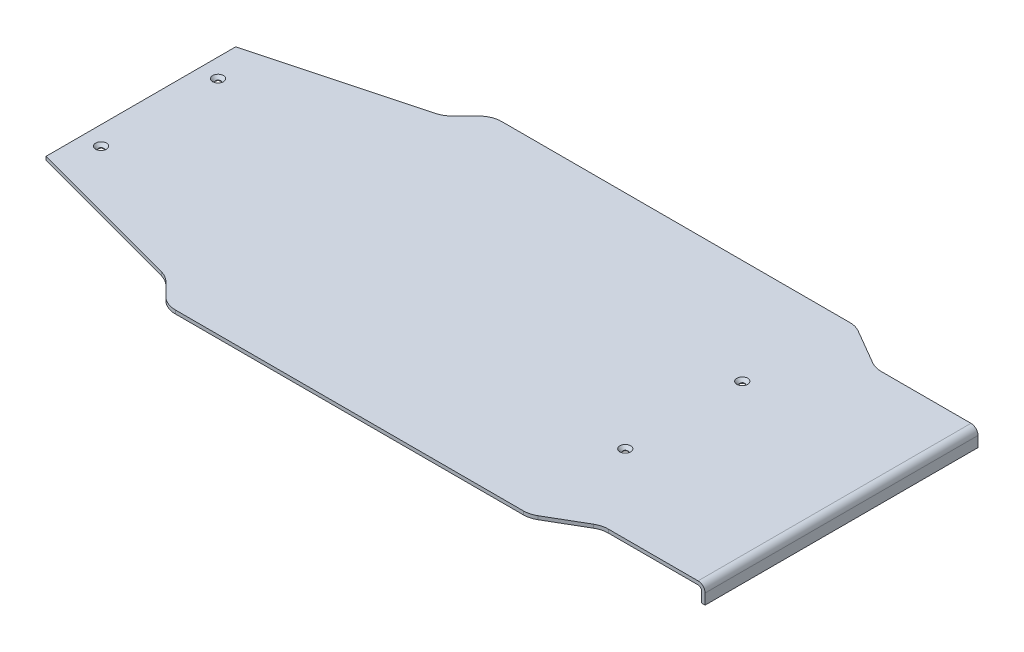
ISO-10303-21;
HEADER;
FILE_DESCRIPTION(('STEP AP214'),'2;1');
FILE_NAME('part.step','',(''),(''),'','','');
FILE_SCHEMA(('AUTOMOTIVE_DESIGN { 1 0 10303 214 1 1 1 1 }'));
ENDSEC;
DATA;
#1=APPLICATION_CONTEXT('core data for automotive mechanical design processes');
#2=APPLICATION_PROTOCOL_DEFINITION('international standard','automotive_design',2000,#1);
#3=PRODUCT_CONTEXT('',#1,'mechanical');
#4=PRODUCT('Part','Part','',(#3));
#5=PRODUCT_RELATED_PRODUCT_CATEGORY('part','',(#4));
#6=PRODUCT_DEFINITION_FORMATION('','',#4);
#7=PRODUCT_DEFINITION_CONTEXT('part definition',#1,'design');
#8=PRODUCT_DEFINITION('design','',#6,#7);
#9=PRODUCT_DEFINITION_SHAPE('','',#8);
#10=(LENGTH_UNIT() NAMED_UNIT(*) SI_UNIT(.MILLI.,.METRE.));
#11=(NAMED_UNIT(*) PLANE_ANGLE_UNIT() SI_UNIT($,.RADIAN.));
#12=(NAMED_UNIT(*) SI_UNIT($,.STERADIAN.) SOLID_ANGLE_UNIT());
#13=UNCERTAINTY_MEASURE_WITH_UNIT(LENGTH_MEASURE(1.E-05),#10,'distance_accuracy_value','');
#14=(GEOMETRIC_REPRESENTATION_CONTEXT(3) GLOBAL_UNCERTAINTY_ASSIGNED_CONTEXT((#13)) GLOBAL_UNIT_ASSIGNED_CONTEXT((#10,
#11,#12)) REPRESENTATION_CONTEXT('',''));
#15=CARTESIAN_POINT('',(0.,0.,0.));
#16=DIRECTION('',(0.,0.,1.));
#17=DIRECTION('',(1.,0.,0.));
#18=AXIS2_PLACEMENT_3D('',#15,#16,#17);
#19=CARTESIAN_POINT('',(70.1639126526197,422.155660423886,226.391038060524));
#20=DIRECTION('',(1.,0.,0.));
#21=DIRECTION('',(0.,0.,-1.));
#22=AXIS2_PLACEMENT_3D('',#19,#20,#21);
#23=PLANE('',#22);
#24=DIRECTION('',(0.,0.,-1.));
#25=VECTOR('',#24,1.);
#26=CARTESIAN_POINT('',(70.1639126526197,407.155674383528,109.733517290147));
#27=LINE('',#26,#25);
#28=CARTESIAN_POINT('',(70.1639126526197,407.155674383528,-6.92392926855557));
#29=VERTEX_POINT('',#28);
#30=CARTESIAN_POINT('',(70.1639126526197,407.155674383528,226.391038060523));
#31=VERTEX_POINT('',#30);
#32=EDGE_CURVE('E125',#29,#31,#27,.F.);
#33=ORIENTED_EDGE('',*,*,#32,.F.);
#34=DIRECTION('',(0.,1.,0.));
#35=VECTOR('',#34,1.);
#36=CARTESIAN_POINT('',(70.1639126526197,422.155660423886,-6.92392926855557));
#37=LINE('',#36,#35);
#38=CARTESIAN_POINT('',(70.1639126526197,416.155660423886,-6.92392926855556));
#39=VERTEX_POINT('',#38);
#40=EDGE_CURVE('E248',#29,#39,#37,.T.);
#41=ORIENTED_EDGE('',*,*,#40,.T.);
#42=DIRECTION('',(0.,0.,1.));
#43=VECTOR('',#42,1.);
#44=CARTESIAN_POINT('',(70.1639126526197,416.155660423886,168.062277675335));
#45=LINE('',#44,#43);
#46=CARTESIAN_POINT('',(70.1639126526197,416.155660423886,226.391038060524));
#47=VERTEX_POINT('',#46);
#48=EDGE_CURVE('E116',#47,#39,#45,.F.);
#49=ORIENTED_EDGE('',*,*,#48,.F.);
#50=DIRECTION('',(0.,1.,0.));
#51=VECTOR('',#50,1.);
#52=CARTESIAN_POINT('',(70.1639126526197,422.155660423886,226.391038060523));
#53=LINE('',#52,#51);
#54=EDGE_CURVE('E220',#47,#31,#53,.F.);
#55=ORIENTED_EDGE('',*,*,#54,.T.);
#56=EDGE_LOOP('',(#33,#41,#49,#55));
#57=FACE_BOUND('',#56,.T.);
#58=ADVANCED_FACE('F16',(#57),#23,.T.);
#59=CARTESIAN_POINT('',(-208.080405510066,407.155674383528,109.733517290147));
#60=DIRECTION('',(0.,-1.,0.));
#61=DIRECTION('',(0.,0.,-1.));
#62=AXIS2_PLACEMENT_3D('',#59,#60,#61);
#63=PLANE('',#62);
#64=ORIENTED_EDGE('',*,*,#32,.T.);
#65=DIRECTION('',(-1.,0.,0.));
#66=VECTOR('',#65,1.);
#67=CARTESIAN_POINT('',(-12.3314943924493,407.155674383528,226.391038060523));
#68=LINE('',#67,#66);
#69=CARTESIAN_POINT('',(67.1639126526197,407.155674383528,226.391038060523));
#70=VERTEX_POINT('',#69);
#71=EDGE_CURVE('E275',#31,#70,#68,.T.);
#72=ORIENTED_EDGE('',*,*,#71,.T.);
#73=DIRECTION('',(0.,0.,1.));
#74=VECTOR('',#73,1.);
#75=CARTESIAN_POINT('',(67.1639126526197,407.155674383528,226.391038060524));
#76=LINE('',#75,#74);
#77=CARTESIAN_POINT('',(67.1639126526197,407.155674383528,-6.92392926855556));
#78=VERTEX_POINT('',#77);
#79=EDGE_CURVE('E260',#78,#70,#76,.T.);
#80=ORIENTED_EDGE('',*,*,#79,.F.);
#81=DIRECTION('',(1.,0.,0.));
#82=VECTOR('',#81,1.);
#83=CARTESIAN_POINT('',(69.6639126526197,407.155674383528,-6.92392926855557));
#84=LINE('',#83,#82);
#85=EDGE_CURVE('E315',#78,#29,#84,.T.);
#86=ORIENTED_EDGE('',*,*,#85,.T.);
#87=EDGE_LOOP('',(#64,#72,#80,#86));
#88=FACE_BOUND('',#87,.T.);
#89=ADVANCED_FACE('F437',(#88),#63,.T.);
#90=CARTESIAN_POINT('',(-208.080405510066,422.155660423886,109.733517290147));
#91=DIRECTION('',(0.,1.,0.));
#92=DIRECTION('',(0.,0.,1.));
#93=AXIS2_PLACEMENT_3D('',#90,#91,#92);
#94=PLANE('',#93);
#95=CARTESIAN_POINT('',(-64.7056657946703,422.155660423925,159.733547090985));
#96=DIRECTION('',(0.,1.,0.));
#97=DIRECTION('',(0.,0.,1.));
#98=AXIS2_PLACEMENT_3D('',#95,#96,#97);
#99=CIRCLE('',#98,4.59998604033873);
#100=CARTESIAN_POINT('',(-64.7056657946703,422.155660423925,164.333533131324));
#101=VERTEX_POINT('',#100);
#102=EDGE_CURVE('E249',#101,#101,#99,.F.);
#103=ORIENTED_EDGE('',*,*,#102,.T.);
#104=EDGE_LOOP('',(#103));
#105=FACE_BOUND('',#104,.T.);
#106=CARTESIAN_POINT('',(-512.898187089314,422.155660423863,59.7335544362883));
#107=DIRECTION('',(0.,1.,0.));
#108=DIRECTION('',(0.,0.,1.));
#109=AXIS2_PLACEMENT_3D('',#106,#107,#108);
#110=CIRCLE('',#109,4.59998604037537);
#111=CARTESIAN_POINT('',(-512.898187089314,422.155660423863,64.3335404766637));
#112=VERTEX_POINT('',#111);
#113=EDGE_CURVE('E253',#112,#112,#110,.F.);
#114=ORIENTED_EDGE('',*,*,#113,.T.);
#115=EDGE_LOOP('',(#114));
#116=FACE_BOUND('',#115,.T.);
#117=CARTESIAN_POINT('',(-64.7056657946703,422.155660423925,59.7335470909851));
#118=DIRECTION('',(0.,1.,0.));
#119=DIRECTION('',(0.,0.,1.));
#120=AXIS2_PLACEMENT_3D('',#117,#118,#119);
#121=CIRCLE('',#120,4.59998604033873);
#122=CARTESIAN_POINT('',(-64.7056657946703,422.155660423925,64.3335331313238));
#123=VERTEX_POINT('',#122);
#124=EDGE_CURVE('E255',#123,#123,#121,.F.);
#125=ORIENTED_EDGE('',*,*,#124,.T.);
#126=EDGE_LOOP('',(#125));
#127=FACE_BOUND('',#126,.T.);
#128=CARTESIAN_POINT('',(-512.898187089314,422.155660423863,159.733554436288));
#129=DIRECTION('',(0.,1.,0.));
#130=DIRECTION('',(0.,0.,1.));
#131=AXIS2_PLACEMENT_3D('',#128,#129,#130);
#132=CIRCLE('',#131,4.59998604037537);
#133=CARTESIAN_POINT('',(-512.898187089314,422.155660423863,164.333540476663));
#134=VERTEX_POINT('',#133);
#135=EDGE_CURVE('E19',#134,#134,#132,.F.);
#136=ORIENTED_EDGE('',*,*,#135,.T.);
#137=EDGE_LOOP('',(#136));
#138=FACE_BOUND('',#137,.T.);
#139=CARTESIAN_POINT('',(-12.3314943924494,422.155660423886,246.891038060524));
#140=DIRECTION('',(0.,-1.,0.));
#141=DIRECTION('',(0.,0.,-1.));
#142=AXIS2_PLACEMENT_3D('',#139,#140,#141);
#143=CIRCLE('',#142,20.5000000000001);
#144=CARTESIAN_POINT('',(-22.6519145198623,422.155660423887,229.178361007247));
#145=VERTEX_POINT('',#144);
#146=CARTESIAN_POINT('',(-12.3314943924493,422.155660423886,226.391038060523));
#147=VERTEX_POINT('',#146);
#148=EDGE_CURVE('E218',#145,#147,#143,.T.);
#149=ORIENTED_EDGE('',*,*,#148,.T.);
#150=DIRECTION('',(-1.,0.,0.));
#151=VECTOR('',#150,1.);
#152=CARTESIAN_POINT('',(-12.3314943924493,422.155660423886,226.391038060523));
#153=LINE('',#152,#151);
#154=CARTESIAN_POINT('',(64.1639126526197,422.155660423886,226.391038060524));
#155=VERTEX_POINT('',#154);
#156=EDGE_CURVE('E217',#147,#155,#153,.F.);
#157=ORIENTED_EDGE('',*,*,#156,.T.);
#158=DIRECTION('',(0.,0.,1.));
#159=VECTOR('',#158,1.);
#160=CARTESIAN_POINT('',(64.1639126526197,422.155660423886,168.062277675335));
#161=LINE('',#160,#159);
#162=CARTESIAN_POINT('',(64.1639126526197,422.155660423886,-6.92392926855555));
#163=VERTEX_POINT('',#162);
#164=EDGE_CURVE('E264',#163,#155,#161,.T.);
#165=ORIENTED_EDGE('',*,*,#164,.F.);
#166=DIRECTION('',(1.,0.,0.));
#167=VECTOR('',#166,1.);
#168=CARTESIAN_POINT('',(69.6639126526197,422.155660423886,-6.92392926855557));
#169=LINE('',#168,#167);
#170=CARTESIAN_POINT('',(-12.3314943924494,422.155660423887,-6.92392926855505));
#171=VERTEX_POINT('',#170);
#172=EDGE_CURVE('E252',#163,#171,#169,.F.);
#173=ORIENTED_EDGE('',*,*,#172,.T.);
#174=CARTESIAN_POINT('',(-12.3314943924495,422.155660423887,-27.4239292685552));
#175=DIRECTION('',(0.,-1.,0.));
#176=DIRECTION('',(0.,0.,-1.));
#177=AXIS2_PLACEMENT_3D('',#174,#175,#176);
#178=CIRCLE('',#177,20.5000000000001);
#179=CARTESIAN_POINT('',(-22.6519145198625,422.155660423887,-9.71125221527799));
#180=VERTEX_POINT('',#179);
#181=EDGE_CURVE('E189',#171,#180,#178,.T.);
#182=ORIENTED_EDGE('',*,*,#181,.T.);
#183=DIRECTION('',(0.864033026989125,0.,0.503435128166489));
#184=VECTOR('',#183,1.);
#185=CARTESIAN_POINT('',(-22.6519145198625,422.155660423887,-9.71125221527797));
#186=LINE('',#185,#184);
#187=CARTESIAN_POINT('',(-52.5216947425072,422.155660423887,-27.1150969353031));
#188=VERTEX_POINT('',#187);
#189=EDGE_CURVE('E188',#180,#188,#186,.F.);
#190=ORIENTED_EDGE('',*,*,#189,.T.);
#191=CARTESIAN_POINT('',(-62.3386797417537,422.155660423887,-10.2664529090152));
#192=DIRECTION('',(0.,-1.,0.));
#193=DIRECTION('',(0.,0.,-1.));
#194=AXIS2_PLACEMENT_3D('',#191,#192,#193);
#195=CIRCLE('',#194,19.4999999999999);
#196=CARTESIAN_POINT('',(-62.3386797417538,422.155660423887,-29.7664529090151));
#197=VERTEX_POINT('',#196);
#198=EDGE_CURVE('E242',#197,#188,#195,.T.);
#199=ORIENTED_EDGE('',*,*,#198,.F.);
#200=DIRECTION('',(1.,0.,0.));
#201=VECTOR('',#200,1.);
#202=CARTESIAN_POINT('',(-62.3386797417538,422.155660423887,-29.7664529090151));
#203=LINE('',#202,#201);
#204=CARTESIAN_POINT('',(-359.91367477702,422.155660423887,-29.7664529090151));
#205=VERTEX_POINT('',#204);
#206=EDGE_CURVE('E241',#197,#205,#203,.F.);
#207=ORIENTED_EDGE('',*,*,#206,.T.);
#208=CARTESIAN_POINT('',(-359.91367477702,422.155660423887,-10.2664529090165));
#209=DIRECTION('',(0.,-1.,0.));
#210=DIRECTION('',(0.,0.,-1.));
#211=AXIS2_PLACEMENT_3D('',#208,#209,#210);
#212=CIRCLE('',#211,19.4999999999987);
#213=CARTESIAN_POINT('',(-373.702257010157,422.155660423887,-24.0550351421531));
#214=VERTEX_POINT('',#213);
#215=EDGE_CURVE('E238',#214,#205,#212,.T.);
#216=ORIENTED_EDGE('',*,*,#215,.F.);
#217=DIRECTION('',(0.707106781186547,0.,-0.707106781186548));
#218=VECTOR('',#217,1.);
#219=CARTESIAN_POINT('',(-373.702257010157,422.155660423887,-24.055035142153));
#220=LINE('',#219,#218);
#221=CARTESIAN_POINT('',(-385.021502796459,422.155660423887,-12.7357893558505));
#222=VERTEX_POINT('',#221);
#223=EDGE_CURVE('E308',#214,#222,#220,.F.);
#224=ORIENTED_EDGE('',*,*,#223,.T.);
#225=CARTESIAN_POINT('',(-399.517191810782,422.155660423887,-27.2314783701729));
#226=DIRECTION('',(0.,-1.,0.));
#227=DIRECTION('',(0.,0.,-1.));
#228=AXIS2_PLACEMENT_3D('',#225,#226,#227);
#229=CIRCLE('',#228,20.4999999999978);
#230=CARTESIAN_POINT('',(-394.211401386181,422.155660423887,-7.42999893124903));
#231=VERTEX_POINT('',#230);
#232=EDGE_CURVE('E234',#222,#231,#229,.T.);
#233=ORIENTED_EDGE('',*,*,#232,.T.);
#234=DIRECTION('',(0.965925826289068,0.,-0.258819045102521));
#235=VECTOR('',#234,1.);
#236=CARTESIAN_POINT('',(-394.211401386181,422.155660423887,-7.429998931249));
#237=LINE('',#236,#235);
#238=CARTESIAN_POINT('',(-528.898187089314,422.155660423887,28.6592165290491));
#239=VERTEX_POINT('',#238);
#240=EDGE_CURVE('E303',#231,#239,#237,.F.);
#241=ORIENTED_EDGE('',*,*,#240,.T.);
#242=DIRECTION('',(0.,0.,-1.));
#243=VECTOR('',#242,1.);
#244=CARTESIAN_POINT('',(-528.898187089314,422.155660423887,28.6592165290491));
#245=LINE('',#244,#243);
#246=CARTESIAN_POINT('',(-528.898187089314,422.155660423886,190.807892262919));
#247=VERTEX_POINT('',#246);
#248=EDGE_CURVE('E297',#239,#247,#245,.F.);
#249=ORIENTED_EDGE('',*,*,#248,.T.);
#250=DIRECTION('',(-0.965925826289068,0.,-0.258819045102521));
#251=VECTOR('',#250,1.);
#252=CARTESIAN_POINT('',(-528.898187089314,422.155660423886,190.807892262919));
#253=LINE('',#252,#251);
#254=CARTESIAN_POINT('',(-394.211401386181,422.155660423886,226.897107723217));
#255=VERTEX_POINT('',#254);
#256=EDGE_CURVE('E292',#247,#255,#253,.F.);
#257=ORIENTED_EDGE('',*,*,#256,.T.);
#258=CARTESIAN_POINT('',(-399.517191810782,422.155660423886,246.698587162141));
#259=DIRECTION('',(0.,-1.,0.));
#260=DIRECTION('',(0.,0.,-1.));
#261=AXIS2_PLACEMENT_3D('',#258,#259,#260);
#262=CIRCLE('',#261,20.4999999999979);
#263=CARTESIAN_POINT('',(-385.021502796459,422.155660423886,232.202898147819));
#264=VERTEX_POINT('',#263);
#265=EDGE_CURVE('E230',#255,#264,#262,.T.);
#266=ORIENTED_EDGE('',*,*,#265,.T.);
#267=DIRECTION('',(-0.707106781186544,0.,-0.707106781186551));
#268=VECTOR('',#267,1.);
#269=CARTESIAN_POINT('',(-385.021502796459,422.155660423886,232.202898147819));
#270=LINE('',#269,#268);
#271=CARTESIAN_POINT('',(-373.702257010157,422.155660423886,243.522143934121));
#272=VERTEX_POINT('',#271);
#273=EDGE_CURVE('E229',#264,#272,#270,.F.);
#274=ORIENTED_EDGE('',*,*,#273,.T.);
#275=CARTESIAN_POINT('',(-359.913674777019,422.155660423886,229.733561700983));
#276=DIRECTION('',(0.,-1.,0.));
#277=DIRECTION('',(0.,0.,-1.));
#278=AXIS2_PLACEMENT_3D('',#275,#276,#277);
#279=CIRCLE('',#278,19.5000000000008);
#280=CARTESIAN_POINT('',(-359.913674777019,422.155660423886,249.233561700984));
#281=VERTEX_POINT('',#280);
#282=EDGE_CURVE('E226',#281,#272,#279,.T.);
#283=ORIENTED_EDGE('',*,*,#282,.F.);
#284=DIRECTION('',(-1.,0.,0.));
#285=VECTOR('',#284,1.);
#286=CARTESIAN_POINT('',(-359.913674777019,422.155660423886,249.233561700984));
#287=LINE('',#286,#285);
#288=CARTESIAN_POINT('',(-62.3386797417537,422.155660423887,249.233561700984));
#289=VERTEX_POINT('',#288);
#290=EDGE_CURVE('E225',#281,#289,#287,.F.);
#291=ORIENTED_EDGE('',*,*,#290,.T.);
#292=CARTESIAN_POINT('',(-62.3386797417535,422.155660423887,229.733561700984));
#293=DIRECTION('',(0.,-1.,0.));
#294=DIRECTION('',(0.,0.,-1.));
#295=AXIS2_PLACEMENT_3D('',#292,#293,#294);
#296=CIRCLE('',#295,19.4999999999992);
#297=CARTESIAN_POINT('',(-52.5216947425071,422.155660423887,246.582205727272));
#298=VERTEX_POINT('',#297);
#299=EDGE_CURVE('E222',#298,#289,#296,.T.);
#300=ORIENTED_EDGE('',*,*,#299,.F.);
#301=DIRECTION('',(-0.864033026989125,0.,0.50343512816649));
#302=VECTOR('',#301,1.);
#303=CARTESIAN_POINT('',(-52.5216947425072,422.155660423887,246.582205727272));
#304=LINE('',#303,#302);
#305=EDGE_CURVE('E284',#298,#145,#304,.F.);
#306=ORIENTED_EDGE('',*,*,#305,.T.);
#307=EDGE_LOOP('',(#149,#157,#165,#173,#182,#190,#199,#207,#216,#224,#233,#241,#249,#257,#266,
#274,#283,#291,#300,#306));
#308=FACE_BOUND('',#307,.T.);
#309=ADVANCED_FACE('F447',(#105,#116,#127,#138,#308),#94,.T.);
#310=CARTESIAN_POINT('',(64.1639126526197,416.155660423886,168.062277675335));
#311=DIRECTION('',(0.,0.,1.));
#312=DIRECTION('',(0.,-1.,0.));
#313=AXIS2_PLACEMENT_3D('',#310,#311,#312);
#314=CYLINDRICAL_SURFACE('',#313,6.);
#315=CARTESIAN_POINT('',(64.1639126526197,416.155660423886,-6.92392926855556));
#316=DIRECTION('',(0.,0.,1.));
#317=DIRECTION('',(0.,-1.,0.));
#318=AXIS2_PLACEMENT_3D('',#315,#316,#317);
#319=CIRCLE('',#318,6.);
#320=EDGE_CURVE('E246',#39,#163,#319,.T.);
#321=ORIENTED_EDGE('',*,*,#320,.T.);
#322=ORIENTED_EDGE('',*,*,#164,.T.);
#323=CARTESIAN_POINT('',(64.1639126526197,416.155660423886,226.391038060524));
#324=DIRECTION('',(0.,0.,1.));
#325=DIRECTION('',(0.,-1.,0.));
#326=AXIS2_PLACEMENT_3D('',#323,#324,#325);
#327=CIRCLE('',#326,6.);
#328=EDGE_CURVE('E215',#155,#47,#327,.F.);
#329=ORIENTED_EDGE('',*,*,#328,.T.);
#330=ORIENTED_EDGE('',*,*,#48,.T.);
#331=EDGE_LOOP('',(#321,#322,#329,#330));
#332=FACE_BOUND('',#331,.T.);
#333=ADVANCED_FACE('F444',(#332),#314,.T.);
#334=CARTESIAN_POINT('',(67.1639126526197,419.155674383528,226.391038060524));
#335=DIRECTION('',(-1.,0.,0.));
#336=DIRECTION('',(0.,0.,1.));
#337=AXIS2_PLACEMENT_3D('',#334,#335,#336);
#338=PLANE('',#337);
#339=ORIENTED_EDGE('',*,*,#79,.T.);
#340=DIRECTION('',(0.,1.,0.));
#341=VECTOR('',#340,1.);
#342=CARTESIAN_POINT('',(67.1639126526197,422.155660423886,226.391038060523));
#343=LINE('',#342,#341);
#344=CARTESIAN_POINT('',(67.1639126526197,416.155674383528,226.391038060524));
#345=VERTEX_POINT('',#344);
#346=EDGE_CURVE('E278',#70,#345,#343,.T.);
#347=ORIENTED_EDGE('',*,*,#346,.T.);
#348=DIRECTION('',(0.,0.,-1.));
#349=VECTOR('',#348,1.);
#350=CARTESIAN_POINT('',(67.1639126526197,416.155674383528,168.062277675335));
#351=LINE('',#350,#349);
#352=CARTESIAN_POINT('',(67.1639126526197,416.155674383528,-6.92392926855556));
#353=VERTEX_POINT('',#352);
#354=EDGE_CURVE('E214',#345,#353,#351,.T.);
#355=ORIENTED_EDGE('',*,*,#354,.T.);
#356=DIRECTION('',(0.,1.,0.));
#357=VECTOR('',#356,1.);
#358=CARTESIAN_POINT('',(67.1639126526197,422.155660423886,-6.92392926855555));
#359=LINE('',#358,#357);
#360=EDGE_CURVE('E318',#353,#78,#359,.F.);
#361=ORIENTED_EDGE('',*,*,#360,.T.);
#362=EDGE_LOOP('',(#339,#347,#355,#361));
#363=FACE_BOUND('',#362,.T.);
#364=ADVANCED_FACE('F430',(#363),#338,.T.);
#365=CARTESIAN_POINT('',(-512.898187089314,422.155660423812,159.733554436288));
#366=DIRECTION('',(0.,1.,0.));
#367=DIRECTION('',(0.,0.,1.));
#368=AXIS2_PLACEMENT_3D('',#365,#366,#367);
#369=CONICAL_SURFACE('',#368,4.59998604032441,0.785398163397448);
#370=CARTESIAN_POINT('',(-512.898187089314,419.655674383528,159.733554436288));
#371=DIRECTION('',(0.,1.,0.));
#372=DIRECTION('',(0.,0.,1.));
#373=AXIS2_PLACEMENT_3D('',#370,#371,#372);
#374=CIRCLE('',#373,2.10000000000001);
#375=CARTESIAN_POINT('',(-512.898187089314,419.655674383528,161.833554436288));
#376=VERTEX_POINT('',#375);
#377=EDGE_CURVE('E210',#376,#376,#374,.F.);
#378=ORIENTED_EDGE('',*,*,#377,.T.);
#379=EDGE_LOOP('',(#378));
#380=FACE_BOUND('',#379,.T.);
#381=ORIENTED_EDGE('',*,*,#135,.F.);
#382=EDGE_LOOP('',(#381));
#383=FACE_BOUND('',#382,.T.);
#384=ADVANCED_FACE('F751',(#380,#383),#369,.F.);
#385=CARTESIAN_POINT('',(-64.7056657946703,422.155660423869,59.7335470909851));
#386=DIRECTION('',(0.,1.,0.));
#387=DIRECTION('',(0.,0.,1.));
#388=AXIS2_PLACEMENT_3D('',#385,#386,#387);
#389=CONICAL_SURFACE('',#388,4.59998604028189,0.78539816338608);
#390=CARTESIAN_POINT('',(-64.7056657946703,419.655674383528,59.7335470909851));
#391=DIRECTION('',(0.,1.,0.));
#392=DIRECTION('',(0.,0.,1.));
#393=AXIS2_PLACEMENT_3D('',#390,#391,#392);
#394=CIRCLE('',#393,2.1);
#395=CARTESIAN_POINT('',(-64.7056657946703,419.655674383528,61.8335470909851));
#396=VERTEX_POINT('',#395);
#397=EDGE_CURVE('E370',#396,#396,#394,.F.);
#398=ORIENTED_EDGE('',*,*,#397,.T.);
#399=EDGE_LOOP('',(#398));
#400=FACE_BOUND('',#399,.T.);
#401=ORIENTED_EDGE('',*,*,#124,.F.);
#402=EDGE_LOOP('',(#401));
#403=FACE_BOUND('',#402,.T.);
#404=ADVANCED_FACE('F742',(#400,#403),#389,.F.);
#405=CARTESIAN_POINT('',(-512.898187089314,422.155660423812,59.7335544362883));
#406=DIRECTION('',(0.,1.,0.));
#407=DIRECTION('',(0.,0.,1.));
#408=AXIS2_PLACEMENT_3D('',#405,#406,#407);
#409=CONICAL_SURFACE('',#408,4.59998604032441,0.785398163397448);
#410=CARTESIAN_POINT('',(-512.898187089314,419.655674383528,59.7335544362883));
#411=DIRECTION('',(0.,1.,0.));
#412=DIRECTION('',(0.,0.,1.));
#413=AXIS2_PLACEMENT_3D('',#410,#411,#412);
#414=CIRCLE('',#413,2.10000000000001);
#415=CARTESIAN_POINT('',(-512.898187089314,419.655674383528,61.8335544362883));
#416=VERTEX_POINT('',#415);
#417=EDGE_CURVE('E367',#416,#416,#414,.F.);
#418=ORIENTED_EDGE('',*,*,#417,.T.);
#419=EDGE_LOOP('',(#418));
#420=FACE_BOUND('',#419,.T.);
#421=ORIENTED_EDGE('',*,*,#113,.F.);
#422=EDGE_LOOP('',(#421));
#423=FACE_BOUND('',#422,.T.);
#424=ADVANCED_FACE('F733',(#420,#423),#409,.F.);
#425=CARTESIAN_POINT('',(-64.7056657946703,422.155660423869,159.733547090985));
#426=DIRECTION('',(0.,1.,0.));
#427=DIRECTION('',(0.,0.,1.));
#428=AXIS2_PLACEMENT_3D('',#425,#426,#427);
#429=CONICAL_SURFACE('',#428,4.59998604028189,0.78539816338608);
#430=CARTESIAN_POINT('',(-64.7056657946703,419.655674383528,159.733547090985));
#431=DIRECTION('',(0.,1.,0.));
#432=DIRECTION('',(0.,0.,1.));
#433=AXIS2_PLACEMENT_3D('',#430,#431,#432);
#434=CIRCLE('',#433,2.10000000000001);
#435=CARTESIAN_POINT('',(-64.7056657946703,419.655674383528,161.833547090985));
#436=VERTEX_POINT('',#435);
#437=EDGE_CURVE('E204',#436,#436,#434,.F.);
#438=ORIENTED_EDGE('',*,*,#437,.T.);
#439=EDGE_LOOP('',(#438));
#440=FACE_BOUND('',#439,.T.);
#441=ORIENTED_EDGE('',*,*,#102,.F.);
#442=EDGE_LOOP('',(#441));
#443=FACE_BOUND('',#442,.T.);
#444=ADVANCED_FACE('F725',(#440,#443),#429,.F.);
#445=CARTESIAN_POINT('',(69.6639126526197,422.155660423886,-6.92392926855557));
#446=DIRECTION('',(0.,0.,1.));
#447=DIRECTION('',(1.,0.,0.));
#448=AXIS2_PLACEMENT_3D('',#445,#446,#447);
#449=PLANE('',#448);
#450=ORIENTED_EDGE('',*,*,#40,.F.);
#451=ORIENTED_EDGE('',*,*,#85,.F.);
#452=ORIENTED_EDGE('',*,*,#360,.F.);
#453=CARTESIAN_POINT('',(64.1639126526197,416.155674383528,-6.92392926855556));
#454=DIRECTION('',(0.,0.,-1.));
#455=DIRECTION('',(0.,1.,0.));
#456=AXIS2_PLACEMENT_3D('',#453,#454,#455);
#457=CIRCLE('',#456,3.);
#458=CARTESIAN_POINT('',(64.1639126526197,419.155674383528,-6.92392926855555));
#459=VERTEX_POINT('',#458);
#460=EDGE_CURVE('E211',#353,#459,#457,.F.);
#461=ORIENTED_EDGE('',*,*,#460,.T.);
#462=DIRECTION('',(1.,0.,0.));
#463=VECTOR('',#462,1.);
#464=CARTESIAN_POINT('',(-208.080405510066,419.155674383528,-6.92392926855553));
#465=LINE('',#464,#463);
#466=CARTESIAN_POINT('',(-12.3314943924495,419.155674383528,-6.92392926855532));
#467=VERTEX_POINT('',#466);
#468=EDGE_CURVE('E202',#459,#467,#465,.F.);
#469=ORIENTED_EDGE('',*,*,#468,.T.);
#470=DIRECTION('',(0.,-1.,0.));
#471=VECTOR('',#470,1.);
#472=CARTESIAN_POINT('',(-12.3314943924494,422.155660423887,-6.9239292685551));
#473=LINE('',#472,#471);
#474=EDGE_CURVE('E175',#467,#171,#473,.F.);
#475=ORIENTED_EDGE('',*,*,#474,.T.);
#476=ORIENTED_EDGE('',*,*,#172,.F.);
#477=ORIENTED_EDGE('',*,*,#320,.F.);
#478=EDGE_LOOP('',(#450,#451,#452,#461,#469,#475,#476,#477));
#479=FACE_BOUND('',#478,.T.);
#480=ADVANCED_FACE('F434',(#479),#449,.F.);
#481=CARTESIAN_POINT('',(-12.3314943924495,422.155660423887,-27.4239292685552));
#482=DIRECTION('',(0.,-1.,0.));
#483=DIRECTION('',(0.,0.,-1.));
#484=AXIS2_PLACEMENT_3D('',#481,#482,#483);
#485=CYLINDRICAL_SURFACE('',#484,20.5000000000001);
#486=DIRECTION('',(0.,1.,0.));
#487=VECTOR('',#486,1.);
#488=CARTESIAN_POINT('',(-22.6519145198625,422.155660423887,-9.71125221527797));
#489=LINE('',#488,#487);
#490=CARTESIAN_POINT('',(-22.6519145198626,419.155674383528,-9.711252215278));
#491=VERTEX_POINT('',#490);
#492=EDGE_CURVE('E182',#491,#180,#489,.T.);
#493=ORIENTED_EDGE('',*,*,#492,.T.);
#494=ORIENTED_EDGE('',*,*,#181,.F.);
#495=ORIENTED_EDGE('',*,*,#474,.F.);
#496=CARTESIAN_POINT('',(-12.3314943924495,419.155674383528,-27.4239292685552));
#497=DIRECTION('',(0.,-1.,0.));
#498=DIRECTION('',(0.,0.,-1.));
#499=AXIS2_PLACEMENT_3D('',#496,#497,#498);
#500=CIRCLE('',#499,20.5000000000001);
#501=EDGE_CURVE('E195',#467,#491,#500,.T.);
#502=ORIENTED_EDGE('',*,*,#501,.T.);
#503=EDGE_LOOP('',(#493,#494,#495,#502));
#504=FACE_BOUND('',#503,.T.);
#505=ADVANCED_FACE('F201',(#504),#485,.F.);
#506=CARTESIAN_POINT('',(-22.6519145198625,422.155660423887,-9.71125221527797));
#507=DIRECTION('',(-0.503435128166489,0.,0.864033026989125));
#508=DIRECTION('',(0.864033026989125,0.,0.503435128166489));
#509=AXIS2_PLACEMENT_3D('',#506,#507,#508);
#510=PLANE('',#509);
#511=DIRECTION('',(0.,-1.,0.));
#512=VECTOR('',#511,1.);
#513=CARTESIAN_POINT('',(-52.5216947425072,422.155660423887,-27.1150969353031));
#514=LINE('',#513,#512);
#515=CARTESIAN_POINT('',(-52.5216947425072,419.155674383528,-27.1150969353031));
#516=VERTEX_POINT('',#515);
#517=EDGE_CURVE('E244',#188,#516,#514,.T.);
#518=ORIENTED_EDGE('',*,*,#517,.F.);
#519=ORIENTED_EDGE('',*,*,#189,.F.);
#520=ORIENTED_EDGE('',*,*,#492,.F.);
#521=DIRECTION('',(-0.864033026989125,0.,-0.50343512816649));
#522=VECTOR('',#521,1.);
#523=CARTESIAN_POINT('',(-22.6519145198625,419.155674383528,-9.71125221527797));
#524=LINE('',#523,#522);
#525=EDGE_CURVE('E186',#491,#516,#524,.T.);
#526=ORIENTED_EDGE('',*,*,#525,.T.);
#527=EDGE_LOOP('',(#518,#519,#520,#526));
#528=FACE_BOUND('',#527,.T.);
#529=ADVANCED_FACE('F185',(#528),#510,.F.);
#530=CARTESIAN_POINT('',(-62.3386797417537,422.155660423887,-10.2664529090152));
#531=DIRECTION('',(0.,-1.,0.));
#532=DIRECTION('',(0.,0.,-1.));
#533=AXIS2_PLACEMENT_3D('',#530,#531,#532);
#534=CYLINDRICAL_SURFACE('',#533,19.4999999999999);
#535=ORIENTED_EDGE('',*,*,#198,.T.);
#536=ORIENTED_EDGE('',*,*,#517,.T.);
#537=CARTESIAN_POINT('',(-62.3386797417537,419.155674383528,-10.2664529090152));
#538=DIRECTION('',(0.,-1.,0.));
#539=DIRECTION('',(0.,0.,-1.));
#540=AXIS2_PLACEMENT_3D('',#537,#538,#539);
#541=CIRCLE('',#540,19.4999999999999);
#542=CARTESIAN_POINT('',(-62.3386797417538,419.155674383528,-29.7664529090151));
#543=VERTEX_POINT('',#542);
#544=EDGE_CURVE('E199',#516,#543,#541,.F.);
#545=ORIENTED_EDGE('',*,*,#544,.T.);
#546=DIRECTION('',(0.,1.,0.));
#547=VECTOR('',#546,1.);
#548=CARTESIAN_POINT('',(-62.3386797417538,422.155660423887,-29.7664529090151));
#549=LINE('',#548,#547);
#550=EDGE_CURVE('E313',#543,#197,#549,.T.);
#551=ORIENTED_EDGE('',*,*,#550,.T.);
#552=EDGE_LOOP('',(#535,#536,#545,#551));
#553=FACE_BOUND('',#552,.T.);
#554=ADVANCED_FACE('F488',(#553),#534,.T.);
#555=CARTESIAN_POINT('',(-62.3386797417538,422.155660423887,-29.7664529090151));
#556=DIRECTION('',(0.,0.,1.));
#557=DIRECTION('',(1.,0.,0.));
#558=AXIS2_PLACEMENT_3D('',#555,#556,#557);
#559=PLANE('',#558);
#560=DIRECTION('',(0.,-1.,0.));
#561=VECTOR('',#560,1.);
#562=CARTESIAN_POINT('',(-359.91367477702,422.155660423887,-29.7664529090152));
#563=LINE('',#562,#561);
#564=CARTESIAN_POINT('',(-359.91367477702,419.155674383528,-29.7664529090152));
#565=VERTEX_POINT('',#564);
#566=EDGE_CURVE('E240',#205,#565,#563,.T.);
#567=ORIENTED_EDGE('',*,*,#566,.F.);
#568=ORIENTED_EDGE('',*,*,#206,.F.);
#569=ORIENTED_EDGE('',*,*,#550,.F.);
#570=DIRECTION('',(1.,0.,0.));
#571=VECTOR('',#570,1.);
#572=CARTESIAN_POINT('',(-208.080405510066,419.155674383528,-29.7664529090151));
#573=LINE('',#572,#571);
#574=EDGE_CURVE('E353',#543,#565,#573,.F.);
#575=ORIENTED_EDGE('',*,*,#574,.T.);
#576=EDGE_LOOP('',(#567,#568,#569,#575));
#577=FACE_BOUND('',#576,.T.);
#578=ADVANCED_FACE('F491',(#577),#559,.F.);
#579=CARTESIAN_POINT('',(-359.91367477702,422.155660423887,-10.2664529090165));
#580=DIRECTION('',(0.,-1.,0.));
#581=DIRECTION('',(0.,0.,-1.));
#582=AXIS2_PLACEMENT_3D('',#579,#580,#581);
#583=CYLINDRICAL_SURFACE('',#582,19.4999999999987);
#584=ORIENTED_EDGE('',*,*,#215,.T.);
#585=ORIENTED_EDGE('',*,*,#566,.T.);
#586=CARTESIAN_POINT('',(-359.91367477702,419.155674383528,-10.2664529090165));
#587=DIRECTION('',(0.,-1.,0.));
#588=DIRECTION('',(0.,0.,-1.));
#589=AXIS2_PLACEMENT_3D('',#586,#587,#588);
#590=CIRCLE('',#589,19.4999999999987);
#591=CARTESIAN_POINT('',(-373.702257010157,419.155674383528,-24.0550351421531));
#592=VERTEX_POINT('',#591);
#593=EDGE_CURVE('E351',#565,#592,#590,.F.);
#594=ORIENTED_EDGE('',*,*,#593,.T.);
#595=DIRECTION('',(0.,1.,0.));
#596=VECTOR('',#595,1.);
#597=CARTESIAN_POINT('',(-373.702257010157,422.155660423887,-24.055035142153));
#598=LINE('',#597,#596);
#599=EDGE_CURVE('E310',#592,#214,#598,.T.);
#600=ORIENTED_EDGE('',*,*,#599,.T.);
#601=EDGE_LOOP('',(#584,#585,#594,#600));
#602=FACE_BOUND('',#601,.T.);
#603=ADVANCED_FACE('F492',(#602),#583,.T.);
#604=CARTESIAN_POINT('',(-373.702257010157,422.155660423887,-24.055035142153));
#605=DIRECTION('',(0.707106781186548,0.,0.707106781186547));
#606=DIRECTION('',(0.707106781186547,0.,-0.707106781186548));
#607=AXIS2_PLACEMENT_3D('',#604,#605,#606);
#608=PLANE('',#607);
#609=DIRECTION('',(0.,-1.,0.));
#610=VECTOR('',#609,1.);
#611=CARTESIAN_POINT('',(-385.021502796459,422.155660423887,-12.7357893558507));
#612=LINE('',#611,#610);
#613=CARTESIAN_POINT('',(-385.021502796459,419.155674383528,-12.7357893558506));
#614=VERTEX_POINT('',#613);
#615=EDGE_CURVE('E237',#614,#222,#612,.F.);
#616=ORIENTED_EDGE('',*,*,#615,.T.);
#617=ORIENTED_EDGE('',*,*,#223,.F.);
#618=ORIENTED_EDGE('',*,*,#599,.F.);
#619=DIRECTION('',(-0.707106781186543,0.,0.707106781186552));
#620=VECTOR('',#619,1.);
#621=CARTESIAN_POINT('',(-373.702257010157,419.155674383528,-24.055035142153));
#622=LINE('',#621,#620);
#623=EDGE_CURVE('E350',#592,#614,#622,.T.);
#624=ORIENTED_EDGE('',*,*,#623,.T.);
#625=EDGE_LOOP('',(#616,#617,#618,#624));
#626=FACE_BOUND('',#625,.T.);
#627=ADVANCED_FACE('F486',(#626),#608,.F.);
#628=CARTESIAN_POINT('',(-399.517191810782,422.155660423887,-27.2314783701729));
#629=DIRECTION('',(0.,-1.,0.));
#630=DIRECTION('',(0.,0.,-1.));
#631=AXIS2_PLACEMENT_3D('',#628,#629,#630);
#632=CYLINDRICAL_SURFACE('',#631,20.4999999999978);
#633=DIRECTION('',(0.,1.,0.));
#634=VECTOR('',#633,1.);
#635=CARTESIAN_POINT('',(-394.211401386181,422.155660423887,-7.429998931249));
#636=LINE('',#635,#634);
#637=CARTESIAN_POINT('',(-394.211401386181,419.155674383528,-7.42999893124903));
#638=VERTEX_POINT('',#637);
#639=EDGE_CURVE('E236',#638,#231,#636,.T.);
#640=ORIENTED_EDGE('',*,*,#639,.T.);
#641=ORIENTED_EDGE('',*,*,#232,.F.);
#642=ORIENTED_EDGE('',*,*,#615,.F.);
#643=CARTESIAN_POINT('',(-399.517191810782,419.155674383528,-27.2314783701729));
#644=DIRECTION('',(0.,-1.,0.));
#645=DIRECTION('',(0.,0.,-1.));
#646=AXIS2_PLACEMENT_3D('',#643,#644,#645);
#647=CIRCLE('',#646,20.4999999999978);
#648=EDGE_CURVE('E347',#614,#638,#647,.T.);
#649=ORIENTED_EDGE('',*,*,#648,.T.);
#650=EDGE_LOOP('',(#640,#641,#642,#649));
#651=FACE_BOUND('',#650,.T.);
#652=ADVANCED_FACE('F482',(#651),#632,.F.);
#653=CARTESIAN_POINT('',(-394.211401386181,422.155660423887,-7.429998931249));
#654=DIRECTION('',(0.258819045102521,0.,0.965925826289068));
#655=DIRECTION('',(0.965925826289068,0.,-0.258819045102521));
#656=AXIS2_PLACEMENT_3D('',#653,#654,#655);
#657=PLANE('',#656);
#658=DIRECTION('',(0.,1.,0.));
#659=VECTOR('',#658,1.);
#660=CARTESIAN_POINT('',(-528.898187089314,422.155660423887,28.6592165290491));
#661=LINE('',#660,#659);
#662=CARTESIAN_POINT('',(-528.898187089314,419.155674383528,28.6592165290491));
#663=VERTEX_POINT('',#662);
#664=EDGE_CURVE('E300',#663,#239,#661,.T.);
#665=ORIENTED_EDGE('',*,*,#664,.T.);
#666=ORIENTED_EDGE('',*,*,#240,.F.);
#667=ORIENTED_EDGE('',*,*,#639,.F.);
#668=DIRECTION('',(-0.965925826289068,0.,0.25881904510252));
#669=VECTOR('',#668,1.);
#670=CARTESIAN_POINT('',(-394.211401386181,419.155674383528,-7.429998931249));
#671=LINE('',#670,#669);
#672=EDGE_CURVE('E349',#638,#663,#671,.T.);
#673=ORIENTED_EDGE('',*,*,#672,.T.);
#674=EDGE_LOOP('',(#665,#666,#667,#673));
#675=FACE_BOUND('',#674,.T.);
#676=ADVANCED_FACE('F473',(#675),#657,.F.);
#677=CARTESIAN_POINT('',(-528.898187089314,422.155660423887,28.6592165290491));
#678=DIRECTION('',(1.,0.,0.));
#679=DIRECTION('',(0.,0.,-1.));
#680=AXIS2_PLACEMENT_3D('',#677,#678,#679);
#681=PLANE('',#680);
#682=DIRECTION('',(0.,1.,0.));
#683=VECTOR('',#682,1.);
#684=CARTESIAN_POINT('',(-528.898187089314,422.155660423886,190.807892262919));
#685=LINE('',#684,#683);
#686=CARTESIAN_POINT('',(-528.898187089314,419.155674383528,190.807892262919));
#687=VERTEX_POINT('',#686);
#688=EDGE_CURVE('E294',#687,#247,#685,.T.);
#689=ORIENTED_EDGE('',*,*,#688,.T.);
#690=ORIENTED_EDGE('',*,*,#248,.F.);
#691=ORIENTED_EDGE('',*,*,#664,.F.);
#692=DIRECTION('',(0.,0.,1.));
#693=VECTOR('',#692,1.);
#694=CARTESIAN_POINT('',(-528.898187089314,419.155674383528,109.733517290147));
#695=LINE('',#694,#693);
#696=EDGE_CURVE('E403',#663,#687,#695,.T.);
#697=ORIENTED_EDGE('',*,*,#696,.T.);
#698=EDGE_LOOP('',(#689,#690,#691,#697));
#699=FACE_BOUND('',#698,.T.);
#700=ADVANCED_FACE('F497',(#699),#681,.F.);
#701=CARTESIAN_POINT('',(-528.898187089314,422.155660423886,190.807892262919));
#702=DIRECTION('',(0.258819045102521,0.,-0.965925826289068));
#703=DIRECTION('',(-0.965925826289068,0.,-0.258819045102521));
#704=AXIS2_PLACEMENT_3D('',#701,#702,#703);
#705=PLANE('',#704);
#706=DIRECTION('',(0.,-1.,0.));
#707=VECTOR('',#706,1.);
#708=CARTESIAN_POINT('',(-394.211401386181,422.155660423886,226.897107723217));
#709=LINE('',#708,#707);
#710=CARTESIAN_POINT('',(-394.211401386181,419.155674383528,226.897107723217));
#711=VERTEX_POINT('',#710);
#712=EDGE_CURVE('E233',#711,#255,#709,.F.);
#713=ORIENTED_EDGE('',*,*,#712,.T.);
#714=ORIENTED_EDGE('',*,*,#256,.F.);
#715=ORIENTED_EDGE('',*,*,#688,.F.);
#716=DIRECTION('',(0.965925826289069,0.,0.25881904510252));
#717=VECTOR('',#716,1.);
#718=CARTESIAN_POINT('',(-528.898187089314,419.155674383528,190.807892262919));
#719=LINE('',#718,#717);
#720=EDGE_CURVE('E346',#687,#711,#719,.T.);
#721=ORIENTED_EDGE('',*,*,#720,.T.);
#722=EDGE_LOOP('',(#713,#714,#715,#721));
#723=FACE_BOUND('',#722,.T.);
#724=ADVANCED_FACE('F501',(#723),#705,.F.);
#725=CARTESIAN_POINT('',(-399.517191810782,422.155660423886,246.698587162141));
#726=DIRECTION('',(0.,-1.,0.));
#727=DIRECTION('',(0.,0.,-1.));
#728=AXIS2_PLACEMENT_3D('',#725,#726,#727);
#729=CYLINDRICAL_SURFACE('',#728,20.4999999999979);
#730=DIRECTION('',(0.,1.,0.));
#731=VECTOR('',#730,1.);
#732=CARTESIAN_POINT('',(-385.021502796459,422.155660423886,232.202898147819));
#733=LINE('',#732,#731);
#734=CARTESIAN_POINT('',(-385.021502796459,419.155674383528,232.202898147819));
#735=VERTEX_POINT('',#734);
#736=EDGE_CURVE('E232',#735,#264,#733,.T.);
#737=ORIENTED_EDGE('',*,*,#736,.T.);
#738=ORIENTED_EDGE('',*,*,#265,.F.);
#739=ORIENTED_EDGE('',*,*,#712,.F.);
#740=CARTESIAN_POINT('',(-399.517191810782,419.155674383528,246.698587162141));
#741=DIRECTION('',(0.,-1.,0.));
#742=DIRECTION('',(0.,0.,-1.));
#743=AXIS2_PLACEMENT_3D('',#740,#741,#742);
#744=CIRCLE('',#743,20.4999999999979);
#745=EDGE_CURVE('E343',#711,#735,#744,.T.);
#746=ORIENTED_EDGE('',*,*,#745,.T.);
#747=EDGE_LOOP('',(#737,#738,#739,#746));
#748=FACE_BOUND('',#747,.T.);
#749=ADVANCED_FACE('F507',(#748),#729,.F.);
#750=CARTESIAN_POINT('',(-385.021502796459,422.155660423886,232.202898147819));
#751=DIRECTION('',(0.707106781186551,0.,-0.707106781186544));
#752=DIRECTION('',(-0.707106781186544,0.,-0.707106781186551));
#753=AXIS2_PLACEMENT_3D('',#750,#751,#752);
#754=PLANE('',#753);
#755=DIRECTION('',(0.,-1.,0.));
#756=VECTOR('',#755,1.);
#757=CARTESIAN_POINT('',(-373.702257010157,422.155660423886,243.522143934121));
#758=LINE('',#757,#756);
#759=CARTESIAN_POINT('',(-373.702257010157,419.155674383528,243.522143934121));
#760=VERTEX_POINT('',#759);
#761=EDGE_CURVE('E228',#272,#760,#758,.T.);
#762=ORIENTED_EDGE('',*,*,#761,.F.);
#763=ORIENTED_EDGE('',*,*,#273,.F.);
#764=ORIENTED_EDGE('',*,*,#736,.F.);
#765=DIRECTION('',(0.707106781186549,0.,0.707106781186546));
#766=VECTOR('',#765,1.);
#767=CARTESIAN_POINT('',(-385.021502796459,419.155674383528,232.202898147819));
#768=LINE('',#767,#766);
#769=EDGE_CURVE('E342',#735,#760,#768,.T.);
#770=ORIENTED_EDGE('',*,*,#769,.T.);
#771=EDGE_LOOP('',(#762,#763,#764,#770));
#772=FACE_BOUND('',#771,.T.);
#773=ADVANCED_FACE('F512',(#772),#754,.F.);
#774=CARTESIAN_POINT('',(-359.913674777019,422.155660423886,229.733561700983));
#775=DIRECTION('',(0.,-1.,0.));
#776=DIRECTION('',(0.,0.,-1.));
#777=AXIS2_PLACEMENT_3D('',#774,#775,#776);
#778=CYLINDRICAL_SURFACE('',#777,19.5000000000008);
#779=ORIENTED_EDGE('',*,*,#282,.T.);
#780=ORIENTED_EDGE('',*,*,#761,.T.);
#781=CARTESIAN_POINT('',(-359.913674777019,419.155674383528,229.733561700983));
#782=DIRECTION('',(0.,-1.,0.));
#783=DIRECTION('',(0.,0.,-1.));
#784=AXIS2_PLACEMENT_3D('',#781,#782,#783);
#785=CIRCLE('',#784,19.5000000000008);
#786=CARTESIAN_POINT('',(-359.913674777019,419.155674383528,249.233561700984));
#787=VERTEX_POINT('',#786);
#788=EDGE_CURVE('E339',#760,#787,#785,.F.);
#789=ORIENTED_EDGE('',*,*,#788,.T.);
#790=DIRECTION('',(0.,1.,0.));
#791=VECTOR('',#790,1.);
#792=CARTESIAN_POINT('',(-359.913674777019,422.155660423886,249.233561700984));
#793=LINE('',#792,#791);
#794=EDGE_CURVE('E289',#787,#281,#793,.T.);
#795=ORIENTED_EDGE('',*,*,#794,.T.);
#796=EDGE_LOOP('',(#779,#780,#789,#795));
#797=FACE_BOUND('',#796,.T.);
#798=ADVANCED_FACE('F514',(#797),#778,.T.);
#799=CARTESIAN_POINT('',(-359.913674777019,422.155660423886,249.233561700984));
#800=DIRECTION('',(0.,0.,-1.));
#801=DIRECTION('',(-1.,0.,0.));
#802=AXIS2_PLACEMENT_3D('',#799,#800,#801);
#803=PLANE('',#802);
#804=DIRECTION('',(0.,-1.,0.));
#805=VECTOR('',#804,1.);
#806=CARTESIAN_POINT('',(-62.3386797417538,422.155660423887,249.233561700983));
#807=LINE('',#806,#805);
#808=CARTESIAN_POINT('',(-62.3386797417537,419.155674383528,249.233561700984));
#809=VERTEX_POINT('',#808);
#810=EDGE_CURVE('E224',#289,#809,#807,.T.);
#811=ORIENTED_EDGE('',*,*,#810,.F.);
#812=ORIENTED_EDGE('',*,*,#290,.F.);
#813=ORIENTED_EDGE('',*,*,#794,.F.);
#814=DIRECTION('',(1.,0.,0.));
#815=VECTOR('',#814,1.);
#816=CARTESIAN_POINT('',(-208.080405510066,419.155674383528,249.233561700984));
#817=LINE('',#816,#815);
#818=EDGE_CURVE('E338',#787,#809,#817,.T.);
#819=ORIENTED_EDGE('',*,*,#818,.T.);
#820=EDGE_LOOP('',(#811,#812,#813,#819));
#821=FACE_BOUND('',#820,.T.);
#822=ADVANCED_FACE('F518',(#821),#803,.F.);
#823=CARTESIAN_POINT('',(-62.3386797417535,422.155660423887,229.733561700984));
#824=DIRECTION('',(0.,-1.,0.));
#825=DIRECTION('',(0.,0.,-1.));
#826=AXIS2_PLACEMENT_3D('',#823,#824,#825);
#827=CYLINDRICAL_SURFACE('',#826,19.4999999999992);
#828=ORIENTED_EDGE('',*,*,#299,.T.);
#829=ORIENTED_EDGE('',*,*,#810,.T.);
#830=CARTESIAN_POINT('',(-62.3386797417535,419.155674383528,229.733561700984));
#831=DIRECTION('',(0.,-1.,0.));
#832=DIRECTION('',(0.,0.,-1.));
#833=AXIS2_PLACEMENT_3D('',#830,#831,#832);
#834=CIRCLE('',#833,19.4999999999992);
#835=CARTESIAN_POINT('',(-52.5216947425069,419.155674383528,246.582205727272));
#836=VERTEX_POINT('',#835);
#837=EDGE_CURVE('E335',#809,#836,#834,.F.);
#838=ORIENTED_EDGE('',*,*,#837,.T.);
#839=DIRECTION('',(0.,1.,0.));
#840=VECTOR('',#839,1.);
#841=CARTESIAN_POINT('',(-52.5216947425072,422.155660423887,246.582205727272));
#842=LINE('',#841,#840);
#843=EDGE_CURVE('E286',#836,#298,#842,.T.);
#844=ORIENTED_EDGE('',*,*,#843,.T.);
#845=EDGE_LOOP('',(#828,#829,#838,#844));
#846=FACE_BOUND('',#845,.T.);
#847=ADVANCED_FACE('F521',(#846),#827,.T.);
#848=CARTESIAN_POINT('',(-52.5216947425072,422.155660423887,246.582205727272));
#849=DIRECTION('',(-0.50343512816649,0.,-0.864033026989125));
#850=DIRECTION('',(-0.864033026989125,0.,0.50343512816649));
#851=AXIS2_PLACEMENT_3D('',#848,#849,#850);
#852=PLANE('',#851);
#853=DIRECTION('',(0.,-1.,0.));
#854=VECTOR('',#853,1.);
#855=CARTESIAN_POINT('',(-22.6519145198621,422.155660423886,229.178361007247));
#856=LINE('',#855,#854);
#857=CARTESIAN_POINT('',(-22.6519145198627,419.155674383528,229.178361007247));
#858=VERTEX_POINT('',#857);
#859=EDGE_CURVE('E221',#858,#145,#856,.F.);
#860=ORIENTED_EDGE('',*,*,#859,.T.);
#861=ORIENTED_EDGE('',*,*,#305,.F.);
#862=ORIENTED_EDGE('',*,*,#843,.F.);
#863=DIRECTION('',(0.864033026989114,0.,-0.503435128166509));
#864=VECTOR('',#863,1.);
#865=CARTESIAN_POINT('',(-52.5216947425072,419.155674383528,246.582205727272));
#866=LINE('',#865,#864);
#867=EDGE_CURVE('E334',#836,#858,#866,.T.);
#868=ORIENTED_EDGE('',*,*,#867,.T.);
#869=EDGE_LOOP('',(#860,#861,#862,#868));
#870=FACE_BOUND('',#869,.T.);
#871=ADVANCED_FACE('F455',(#870),#852,.F.);
#872=CARTESIAN_POINT('',(-12.3314943924494,422.155660423886,246.891038060524));
#873=DIRECTION('',(0.,-1.,0.));
#874=DIRECTION('',(0.,0.,-1.));
#875=AXIS2_PLACEMENT_3D('',#872,#873,#874);
#876=CYLINDRICAL_SURFACE('',#875,20.5000000000001);
#877=DIRECTION('',(0.,1.,0.));
#878=VECTOR('',#877,1.);
#879=CARTESIAN_POINT('',(-12.3314943924493,422.155660423886,226.391038060523));
#880=LINE('',#879,#878);
#881=CARTESIAN_POINT('',(-12.3314943924493,419.155674383528,226.391038060523));
#882=VERTEX_POINT('',#881);
#883=EDGE_CURVE('E377',#882,#147,#880,.T.);
#884=ORIENTED_EDGE('',*,*,#883,.T.);
#885=ORIENTED_EDGE('',*,*,#148,.F.);
#886=ORIENTED_EDGE('',*,*,#859,.F.);
#887=CARTESIAN_POINT('',(-12.3314943924494,419.155674383528,246.891038060524));
#888=DIRECTION('',(0.,-1.,0.));
#889=DIRECTION('',(0.,0.,-1.));
#890=AXIS2_PLACEMENT_3D('',#887,#888,#889);
#891=CIRCLE('',#890,20.5000000000001);
#892=EDGE_CURVE('E330',#858,#882,#891,.T.);
#893=ORIENTED_EDGE('',*,*,#892,.T.);
#894=EDGE_LOOP('',(#884,#885,#886,#893));
#895=FACE_BOUND('',#894,.T.);
#896=ADVANCED_FACE('F451',(#895),#876,.F.);
#897=CARTESIAN_POINT('',(-12.3314943924493,422.155660423886,226.391038060523));
#898=DIRECTION('',(0.,0.,-1.));
#899=DIRECTION('',(-1.,0.,0.));
#900=AXIS2_PLACEMENT_3D('',#897,#898,#899);
#901=PLANE('',#900);
#902=ORIENTED_EDGE('',*,*,#156,.F.);
#903=ORIENTED_EDGE('',*,*,#883,.F.);
#904=DIRECTION('',(1.,0.,0.));
#905=VECTOR('',#904,1.);
#906=CARTESIAN_POINT('',(-208.080405510066,419.155674383528,226.391038060523));
#907=LINE('',#906,#905);
#908=CARTESIAN_POINT('',(64.1639126526197,419.155674383528,226.391038060524));
#909=VERTEX_POINT('',#908);
#910=EDGE_CURVE('E333',#882,#909,#907,.T.);
#911=ORIENTED_EDGE('',*,*,#910,.T.);
#912=CARTESIAN_POINT('',(64.1639126526197,416.155674383528,226.391038060524));
#913=DIRECTION('',(0.,0.,-1.));
#914=DIRECTION('',(0.,1.,0.));
#915=AXIS2_PLACEMENT_3D('',#912,#913,#914);
#916=CIRCLE('',#915,3.);
#917=EDGE_CURVE('E34',#909,#345,#916,.T.);
#918=ORIENTED_EDGE('',*,*,#917,.T.);
#919=ORIENTED_EDGE('',*,*,#346,.F.);
#920=ORIENTED_EDGE('',*,*,#71,.F.);
#921=ORIENTED_EDGE('',*,*,#54,.F.);
#922=ORIENTED_EDGE('',*,*,#328,.F.);
#923=EDGE_LOOP('',(#902,#903,#911,#918,#919,#920,#921,#922));
#924=FACE_BOUND('',#923,.T.);
#925=ADVANCED_FACE('F442',(#924),#901,.F.);
#926=CARTESIAN_POINT('',(64.1639126526197,416.155674383528,168.062277675335));
#927=DIRECTION('',(0.,0.,-1.));
#928=DIRECTION('',(0.,1.,0.));
#929=AXIS2_PLACEMENT_3D('',#926,#927,#928);
#930=CYLINDRICAL_SURFACE('',#929,3.);
#931=DIRECTION('',(0.,0.,1.));
#932=VECTOR('',#931,1.);
#933=CARTESIAN_POINT('',(64.1639126526197,419.155674383528,109.733517290147));
#934=LINE('',#933,#932);
#935=EDGE_CURVE('E329',#909,#459,#934,.F.);
#936=ORIENTED_EDGE('',*,*,#935,.T.);
#937=ORIENTED_EDGE('',*,*,#460,.F.);
#938=ORIENTED_EDGE('',*,*,#354,.F.);
#939=ORIENTED_EDGE('',*,*,#917,.F.);
#940=EDGE_LOOP('',(#936,#937,#938,#939));
#941=FACE_BOUND('',#940,.T.);
#942=ADVANCED_FACE('F432',(#941),#930,.F.);
#943=CARTESIAN_POINT('',(-512.898187089314,419.155674383528,159.733554436288));
#944=DIRECTION('',(0.,1.,0.));
#945=DIRECTION('',(0.,0.,1.));
#946=AXIS2_PLACEMENT_3D('',#943,#944,#945);
#947=CYLINDRICAL_SURFACE('',#946,2.10000000000001);
#948=ORIENTED_EDGE('',*,*,#377,.F.);
#949=EDGE_LOOP('',(#948));
#950=FACE_BOUND('',#949,.T.);
#951=CARTESIAN_POINT('',(-512.898187089314,419.155674383528,159.733554436288));
#952=DIRECTION('',(0.,1.,0.));
#953=DIRECTION('',(0.,0.,1.));
#954=AXIS2_PLACEMENT_3D('',#951,#952,#953);
#955=CIRCLE('',#954,2.10000000000001);
#956=CARTESIAN_POINT('',(-512.898187089314,419.155674383528,161.833554436288));
#957=VERTEX_POINT('',#956);
#958=EDGE_CURVE('E326',#957,#957,#955,.F.);
#959=ORIENTED_EDGE('',*,*,#958,.T.);
#960=EDGE_LOOP('',(#959));
#961=FACE_BOUND('',#960,.T.);
#962=ADVANCED_FACE('F550',(#950,#961),#947,.F.);
#963=CARTESIAN_POINT('',(-64.7056657946703,419.155674383528,59.7335470909851));
#964=DIRECTION('',(0.,1.,0.));
#965=DIRECTION('',(0.,0.,1.));
#966=AXIS2_PLACEMENT_3D('',#963,#964,#965);
#967=CYLINDRICAL_SURFACE('',#966,2.1);
#968=ORIENTED_EDGE('',*,*,#397,.F.);
#969=EDGE_LOOP('',(#968));
#970=FACE_BOUND('',#969,.T.);
#971=CARTESIAN_POINT('',(-64.7056657946703,419.155674383528,59.7335470909851));
#972=DIRECTION('',(0.,1.,0.));
#973=DIRECTION('',(0.,0.,1.));
#974=AXIS2_PLACEMENT_3D('',#971,#972,#973);
#975=CIRCLE('',#974,2.1);
#976=CARTESIAN_POINT('',(-64.7056657946703,419.155674383528,61.8335470909851));
#977=VERTEX_POINT('',#976);
#978=EDGE_CURVE('E323',#977,#977,#975,.F.);
#979=ORIENTED_EDGE('',*,*,#978,.T.);
#980=EDGE_LOOP('',(#979));
#981=FACE_BOUND('',#980,.T.);
#982=ADVANCED_FACE('F546',(#970,#981),#967,.F.);
#983=CARTESIAN_POINT('',(-512.898187089314,419.155674383528,59.7335544362883));
#984=DIRECTION('',(0.,1.,0.));
#985=DIRECTION('',(0.,0.,1.));
#986=AXIS2_PLACEMENT_3D('',#983,#984,#985);
#987=CYLINDRICAL_SURFACE('',#986,2.10000000000001);
#988=ORIENTED_EDGE('',*,*,#417,.F.);
#989=EDGE_LOOP('',(#988));
#990=FACE_BOUND('',#989,.T.);
#991=CARTESIAN_POINT('',(-512.898187089314,419.155674383528,59.7335544362883));
#992=DIRECTION('',(0.,1.,0.));
#993=DIRECTION('',(0.,0.,1.));
#994=AXIS2_PLACEMENT_3D('',#991,#992,#993);
#995=CIRCLE('',#994,2.10000000000001);
#996=CARTESIAN_POINT('',(-512.898187089314,419.155674383528,61.8335544362883));
#997=VERTEX_POINT('',#996);
#998=EDGE_CURVE('E25',#997,#997,#995,.F.);
#999=ORIENTED_EDGE('',*,*,#998,.T.);
#1000=EDGE_LOOP('',(#999));
#1001=FACE_BOUND('',#1000,.T.);
#1002=ADVANCED_FACE('F538',(#990,#1001),#987,.F.);
#1003=CARTESIAN_POINT('',(-64.7056657946703,419.155674383528,159.733547090985));
#1004=DIRECTION('',(0.,1.,0.));
#1005=DIRECTION('',(0.,0.,1.));
#1006=AXIS2_PLACEMENT_3D('',#1003,#1004,#1005);
#1007=CYLINDRICAL_SURFACE('',#1006,2.10000000000001);
#1008=ORIENTED_EDGE('',*,*,#437,.F.);
#1009=EDGE_LOOP('',(#1008));
#1010=FACE_BOUND('',#1009,.T.);
#1011=CARTESIAN_POINT('',(-64.7056657946703,419.155674383528,159.733547090985));
#1012=DIRECTION('',(0.,1.,0.));
#1013=DIRECTION('',(0.,0.,1.));
#1014=AXIS2_PLACEMENT_3D('',#1011,#1012,#1013);
#1015=CIRCLE('',#1014,2.10000000000001);
#1016=CARTESIAN_POINT('',(-64.7056657946703,419.155674383528,161.833547090985));
#1017=VERTEX_POINT('',#1016);
#1018=EDGE_CURVE('E11',#1017,#1017,#1015,.F.);
#1019=ORIENTED_EDGE('',*,*,#1018,.T.);
#1020=EDGE_LOOP('',(#1019));
#1021=FACE_BOUND('',#1020,.T.);
#1022=ADVANCED_FACE('F532',(#1010,#1021),#1007,.F.);
#1023=CARTESIAN_POINT('',(-208.080405510066,419.155674383528,109.733517290147));
#1024=DIRECTION('',(0.,1.,0.));
#1025=DIRECTION('',(0.,0.,1.));
#1026=AXIS2_PLACEMENT_3D('',#1023,#1024,#1025);
#1027=PLANE('',#1026);
#1028=ORIENTED_EDGE('',*,*,#1018,.F.);
#1029=EDGE_LOOP('',(#1028));
#1030=FACE_BOUND('',#1029,.T.);
#1031=ORIENTED_EDGE('',*,*,#998,.F.);
#1032=EDGE_LOOP('',(#1031));
#1033=FACE_BOUND('',#1032,.T.);
#1034=ORIENTED_EDGE('',*,*,#978,.F.);
#1035=EDGE_LOOP('',(#1034));
#1036=FACE_BOUND('',#1035,.T.);
#1037=ORIENTED_EDGE('',*,*,#958,.F.);
#1038=EDGE_LOOP('',(#1037));
#1039=FACE_BOUND('',#1038,.T.);
#1040=ORIENTED_EDGE('',*,*,#910,.F.);
#1041=ORIENTED_EDGE('',*,*,#892,.F.);
#1042=ORIENTED_EDGE('',*,*,#867,.F.);
#1043=ORIENTED_EDGE('',*,*,#837,.F.);
#1044=ORIENTED_EDGE('',*,*,#818,.F.);
#1045=ORIENTED_EDGE('',*,*,#788,.F.);
#1046=ORIENTED_EDGE('',*,*,#769,.F.);
#1047=ORIENTED_EDGE('',*,*,#745,.F.);
#1048=ORIENTED_EDGE('',*,*,#720,.F.);
#1049=ORIENTED_EDGE('',*,*,#696,.F.);
#1050=ORIENTED_EDGE('',*,*,#672,.F.);
#1051=ORIENTED_EDGE('',*,*,#648,.F.);
#1052=ORIENTED_EDGE('',*,*,#623,.F.);
#1053=ORIENTED_EDGE('',*,*,#593,.F.);
#1054=ORIENTED_EDGE('',*,*,#574,.F.);
#1055=ORIENTED_EDGE('',*,*,#544,.F.);
#1056=ORIENTED_EDGE('',*,*,#525,.F.);
#1057=ORIENTED_EDGE('',*,*,#501,.F.);
#1058=ORIENTED_EDGE('',*,*,#468,.F.);
#1059=ORIENTED_EDGE('',*,*,#935,.F.);
#1060=EDGE_LOOP('',(#1040,#1041,#1042,#1043,#1044,#1045,#1046,#1047,#1048,#1049,#1050,#1051,
#1052,#1053,#1054,#1055,#1056,#1057,#1058,#1059));
#1061=FACE_BOUND('',#1060,.T.);
#1062=ADVANCED_FACE('F194',(#1030,#1033,#1036,#1039,#1061),#1027,.F.);
#1063=CLOSED_SHELL('',(#58,#89,#309,#333,#364,#384,#404,#424,#444,#480,#505,#529,#554,#578,#603,
#627,#652,#676,#700,#724,#749,#773,#798,#822,#847,#871,#896,#925,#942,#962,#982,#1002,#1022,#1062));
#1064=MANIFOLD_SOLID_BREP('B1',#1063);
#1065=ADVANCED_BREP_SHAPE_REPRESENTATION('',(#18,#1064),#14);
#1066=SHAPE_DEFINITION_REPRESENTATION(#9,#1065);
ENDSEC;
END-ISO-10303-21;
